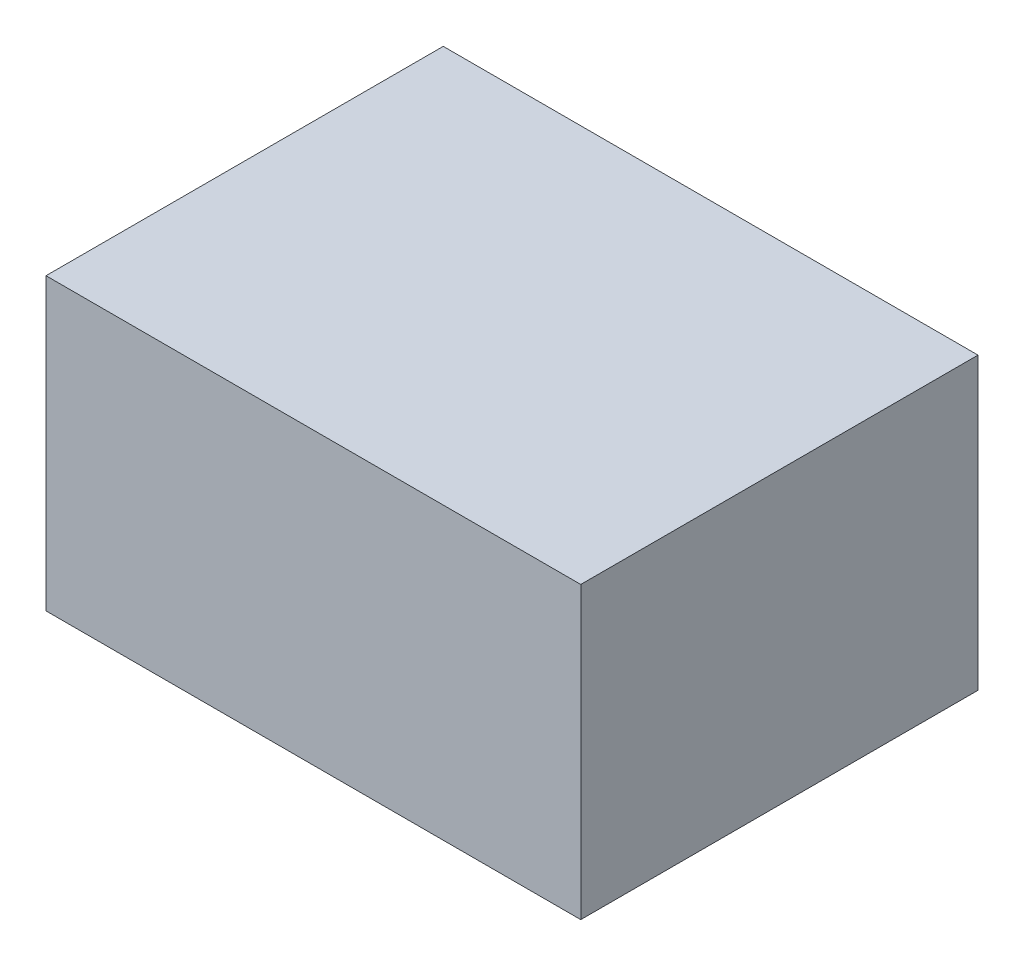
ISO-10303-21;
HEADER;
FILE_DESCRIPTION(('STEP AP214'),'2;1');
FILE_NAME('part.step','',(''),(''),'','','');
FILE_SCHEMA(('AUTOMOTIVE_DESIGN { 1 0 10303 214 1 1 1 1 }'));
ENDSEC;
DATA;
#1=APPLICATION_CONTEXT('core data for automotive mechanical design processes');
#2=APPLICATION_PROTOCOL_DEFINITION('international standard','automotive_design',2000,#1);
#3=PRODUCT_CONTEXT('',#1,'mechanical');
#4=PRODUCT('Part','Part','',(#3));
#5=PRODUCT_RELATED_PRODUCT_CATEGORY('part','',(#4));
#6=PRODUCT_DEFINITION_FORMATION('','',#4);
#7=PRODUCT_DEFINITION_CONTEXT('part definition',#1,'design');
#8=PRODUCT_DEFINITION('design','',#6,#7);
#9=PRODUCT_DEFINITION_SHAPE('','',#8);
#10=(LENGTH_UNIT() NAMED_UNIT(*) SI_UNIT(.MILLI.,.METRE.));
#11=(NAMED_UNIT(*) PLANE_ANGLE_UNIT() SI_UNIT($,.RADIAN.));
#12=(NAMED_UNIT(*) SI_UNIT($,.STERADIAN.) SOLID_ANGLE_UNIT());
#13=UNCERTAINTY_MEASURE_WITH_UNIT(LENGTH_MEASURE(1.E-05),#10,'distance_accuracy_value','');
#14=(GEOMETRIC_REPRESENTATION_CONTEXT(3) GLOBAL_UNCERTAINTY_ASSIGNED_CONTEXT((#13)) GLOBAL_UNIT_ASSIGNED_CONTEXT((#10,
#11,#12)) REPRESENTATION_CONTEXT('',''));
#15=CARTESIAN_POINT('',(0.,0.,0.));
#16=DIRECTION('',(0.,0.,1.));
#17=DIRECTION('',(1.,0.,0.));
#18=AXIS2_PLACEMENT_3D('',#15,#16,#17);
#19=CARTESIAN_POINT('',(0.87499952,0.47500032,0.));
#20=DIRECTION('',(0.,-1.,0.));
#21=DIRECTION('',(0.,0.,-1.));
#22=AXIS2_PLACEMENT_3D('',#19,#20,#21);
#23=PLANE('',#22);
#24=DIRECTION('',(0.,0.,-1.));
#25=VECTOR('',#24,1.);
#26=CARTESIAN_POINT('',(-0.87499952,0.47500032,0.));
#27=LINE('',#26,#25);
#28=CARTESIAN_POINT('',(-0.87499952,0.47500032,0.));
#29=VERTEX_POINT('',#28);
#30=CARTESIAN_POINT('',(-0.87499952,0.47500032,1.29999994));
#31=VERTEX_POINT('',#30);
#32=EDGE_CURVE('E19',#29,#31,#27,.F.);
#33=ORIENTED_EDGE('',*,*,#32,.T.);
#34=DIRECTION('',(-1.,0.,0.));
#35=VECTOR('',#34,1.);
#36=CARTESIAN_POINT('',(-0.87499952,0.47500032,1.29999994));
#37=LINE('',#36,#35);
#38=CARTESIAN_POINT('',(0.87499952,0.47500032,1.29999994));
#39=VERTEX_POINT('',#38);
#40=EDGE_CURVE('E54',#31,#39,#37,.F.);
#41=ORIENTED_EDGE('',*,*,#40,.T.);
#42=DIRECTION('',(0.,0.,1.));
#43=VECTOR('',#42,1.);
#44=CARTESIAN_POINT('',(0.87499952,0.47500032,0.));
#45=LINE('',#44,#43);
#46=CARTESIAN_POINT('',(0.87499952,0.47500032,0.));
#47=VERTEX_POINT('',#46);
#48=EDGE_CURVE('E75',#39,#47,#45,.F.);
#49=ORIENTED_EDGE('',*,*,#48,.T.);
#50=DIRECTION('',(-1.,0.,0.));
#51=VECTOR('',#50,1.);
#52=CARTESIAN_POINT('',(-0.87499952,0.47500032,0.));
#53=LINE('',#52,#51);
#54=EDGE_CURVE('E57',#29,#47,#53,.F.);
#55=ORIENTED_EDGE('',*,*,#54,.F.);
#56=EDGE_LOOP('',(#33,#41,#49,#55));
#57=FACE_BOUND('',#56,.T.);
#58=ADVANCED_FACE('F16',(#57),#23,.F.);
#59=CARTESIAN_POINT('',(-0.87499952,0.47500032,0.));
#60=DIRECTION('',(1.,0.,0.));
#61=DIRECTION('',(0.,0.,-1.));
#62=AXIS2_PLACEMENT_3D('',#59,#60,#61);
#63=PLANE('',#62);
#64=DIRECTION('',(0.,0.,1.));
#65=VECTOR('',#64,1.);
#66=CARTESIAN_POINT('',(-0.87499952,-0.47500032,0.));
#67=LINE('',#66,#65);
#68=CARTESIAN_POINT('',(-0.87499952,-0.47500032,0.));
#69=VERTEX_POINT('',#68);
#70=CARTESIAN_POINT('',(-0.87499952,-0.47500032,1.29999994));
#71=VERTEX_POINT('',#70);
#72=EDGE_CURVE('E72',#69,#71,#67,.T.);
#73=ORIENTED_EDGE('',*,*,#72,.T.);
#74=DIRECTION('',(0.,1.,0.));
#75=VECTOR('',#74,1.);
#76=CARTESIAN_POINT('',(-0.87499952,-0.47500032,1.29999994));
#77=LINE('',#76,#75);
#78=EDGE_CURVE('E62',#71,#31,#77,.T.);
#79=ORIENTED_EDGE('',*,*,#78,.T.);
#80=ORIENTED_EDGE('',*,*,#32,.F.);
#81=DIRECTION('',(0.,1.,0.));
#82=VECTOR('',#81,1.);
#83=CARTESIAN_POINT('',(-0.87499952,-0.47500032,0.));
#84=LINE('',#83,#82);
#85=EDGE_CURVE('E77',#69,#29,#84,.T.);
#86=ORIENTED_EDGE('',*,*,#85,.F.);
#87=EDGE_LOOP('',(#73,#79,#80,#86));
#88=FACE_BOUND('',#87,.T.);
#89=ADVANCED_FACE('F71',(#88),#63,.F.);
#90=CARTESIAN_POINT('',(-0.87499952,-0.47500032,1.29999994));
#91=DIRECTION('',(0.,0.,-1.));
#92=DIRECTION('',(-1.,0.,0.));
#93=AXIS2_PLACEMENT_3D('',#90,#91,#92);
#94=PLANE('',#93);
#95=DIRECTION('',(0.,1.,0.));
#96=VECTOR('',#95,1.);
#97=CARTESIAN_POINT('',(0.87499952,-0.47500032,1.29999994));
#98=LINE('',#97,#96);
#99=CARTESIAN_POINT('',(0.87499952,-0.47500032,1.29999994));
#100=VERTEX_POINT('',#99);
#101=EDGE_CURVE('E68',#100,#39,#98,.T.);
#102=ORIENTED_EDGE('',*,*,#101,.T.);
#103=ORIENTED_EDGE('',*,*,#40,.F.);
#104=ORIENTED_EDGE('',*,*,#78,.F.);
#105=DIRECTION('',(1.,0.,0.));
#106=VECTOR('',#105,1.);
#107=CARTESIAN_POINT('',(-0.87499952,-0.47500032,1.29999994));
#108=LINE('',#107,#106);
#109=EDGE_CURVE('E82',#71,#100,#108,.T.);
#110=ORIENTED_EDGE('',*,*,#109,.T.);
#111=EDGE_LOOP('',(#102,#103,#104,#110));
#112=FACE_BOUND('',#111,.T.);
#113=ADVANCED_FACE('F65',(#112),#94,.F.);
#114=CARTESIAN_POINT('',(0.87499952,-0.47500032,0.));
#115=DIRECTION('',(-1.,0.,0.));
#116=DIRECTION('',(0.,0.,1.));
#117=AXIS2_PLACEMENT_3D('',#114,#115,#116);
#118=PLANE('',#117);
#119=ORIENTED_EDGE('',*,*,#48,.F.);
#120=ORIENTED_EDGE('',*,*,#101,.F.);
#121=DIRECTION('',(0.,0.,1.));
#122=VECTOR('',#121,1.);
#123=CARTESIAN_POINT('',(0.87499952,-0.47500032,0.));
#124=LINE('',#123,#122);
#125=CARTESIAN_POINT('',(0.87499952,-0.47500032,0.));
#126=VERTEX_POINT('',#125);
#127=EDGE_CURVE('E25',#100,#126,#124,.F.);
#128=ORIENTED_EDGE('',*,*,#127,.T.);
#129=DIRECTION('',(0.,1.,0.));
#130=VECTOR('',#129,1.);
#131=CARTESIAN_POINT('',(0.87499952,-0.47500032,0.));
#132=LINE('',#131,#130);
#133=EDGE_CURVE('E33',#47,#126,#132,.F.);
#134=ORIENTED_EDGE('',*,*,#133,.F.);
#135=EDGE_LOOP('',(#119,#120,#128,#134));
#136=FACE_BOUND('',#135,.T.);
#137=ADVANCED_FACE('F87',(#136),#118,.F.);
#138=CARTESIAN_POINT('',(-0.87499952,-0.47500032,0.));
#139=DIRECTION('',(0.,0.,-1.));
#140=DIRECTION('',(-1.,0.,0.));
#141=AXIS2_PLACEMENT_3D('',#138,#139,#140);
#142=PLANE('',#141);
#143=ORIENTED_EDGE('',*,*,#133,.T.);
#144=DIRECTION('',(1.,0.,0.));
#145=VECTOR('',#144,1.);
#146=CARTESIAN_POINT('',(-0.87499952,-0.47500032,0.));
#147=LINE('',#146,#145);
#148=EDGE_CURVE('E11',#126,#69,#147,.F.);
#149=ORIENTED_EDGE('',*,*,#148,.T.);
#150=ORIENTED_EDGE('',*,*,#85,.T.);
#151=ORIENTED_EDGE('',*,*,#54,.T.);
#152=EDGE_LOOP('',(#143,#149,#150,#151));
#153=FACE_BOUND('',#152,.T.);
#154=ADVANCED_FACE('F90',(#153),#142,.T.);
#155=CARTESIAN_POINT('',(-0.87499952,-0.47500032,0.));
#156=DIRECTION('',(0.,1.,0.));
#157=DIRECTION('',(0.,0.,1.));
#158=AXIS2_PLACEMENT_3D('',#155,#156,#157);
#159=PLANE('',#158);
#160=ORIENTED_EDGE('',*,*,#127,.F.);
#161=ORIENTED_EDGE('',*,*,#109,.F.);
#162=ORIENTED_EDGE('',*,*,#72,.F.);
#163=ORIENTED_EDGE('',*,*,#148,.F.);
#164=EDGE_LOOP('',(#160,#161,#162,#163));
#165=FACE_BOUND('',#164,.T.);
#166=ADVANCED_FACE('F89',(#165),#159,.F.);
#167=CLOSED_SHELL('',(#58,#89,#113,#137,#154,#166));
#168=MANIFOLD_SOLID_BREP('B1',#167);
#169=ADVANCED_BREP_SHAPE_REPRESENTATION('',(#18,#168),#14);
#170=SHAPE_DEFINITION_REPRESENTATION(#9,#169);
ENDSEC;
END-ISO-10303-21;
